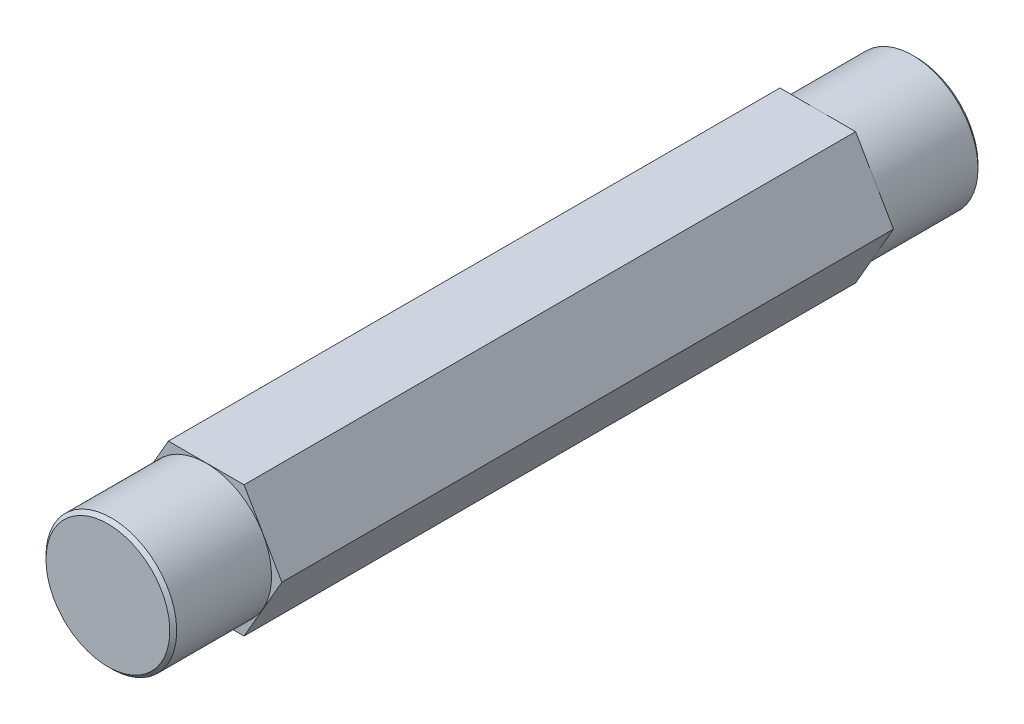
ISO-10303-21;
HEADER;
FILE_DESCRIPTION(('STEP AP214'),'2;1');
FILE_NAME('part.step','',(''),(''),'','','');
FILE_SCHEMA(('AUTOMOTIVE_DESIGN { 1 0 10303 214 1 1 1 1 }'));
ENDSEC;
DATA;
#1=APPLICATION_CONTEXT('core data for automotive mechanical design processes');
#2=APPLICATION_PROTOCOL_DEFINITION('international standard','automotive_design',2000,#1);
#3=PRODUCT_CONTEXT('',#1,'mechanical');
#4=PRODUCT('Part','Part','',(#3));
#5=PRODUCT_RELATED_PRODUCT_CATEGORY('part','',(#4));
#6=PRODUCT_DEFINITION_FORMATION('','',#4);
#7=PRODUCT_DEFINITION_CONTEXT('part definition',#1,'design');
#8=PRODUCT_DEFINITION('design','',#6,#7);
#9=PRODUCT_DEFINITION_SHAPE('','',#8);
#10=(LENGTH_UNIT() NAMED_UNIT(*) SI_UNIT(.MILLI.,.METRE.));
#11=(NAMED_UNIT(*) PLANE_ANGLE_UNIT() SI_UNIT($,.RADIAN.));
#12=(NAMED_UNIT(*) SI_UNIT($,.STERADIAN.) SOLID_ANGLE_UNIT());
#13=UNCERTAINTY_MEASURE_WITH_UNIT(LENGTH_MEASURE(1.E-05),#10,'distance_accuracy_value','');
#14=(GEOMETRIC_REPRESENTATION_CONTEXT(3) GLOBAL_UNCERTAINTY_ASSIGNED_CONTEXT((#13)) GLOBAL_UNIT_ASSIGNED_CONTEXT((#10,
#11,#12)) REPRESENTATION_CONTEXT('',''));
#15=CARTESIAN_POINT('',(0.,0.,0.));
#16=DIRECTION('',(0.,0.,1.));
#17=DIRECTION('',(1.,0.,0.));
#18=AXIS2_PLACEMENT_3D('',#15,#16,#17);
#19=CARTESIAN_POINT('',(0.,0.,29.36875));
#20=DIRECTION('',(0.,0.,1.));
#21=DIRECTION('',(1.,0.,0.));
#22=AXIS2_PLACEMENT_3D('',#19,#20,#21);
#23=PLANE('',#22);
#24=CARTESIAN_POINT('',(0.,0.,29.3687500000033));
#25=DIRECTION('',(0.,0.,-1.));
#26=DIRECTION('',(-1.,0.,0.));
#27=AXIS2_PLACEMENT_3D('',#24,#25,#26);
#28=CIRCLE('',#27,4.49980000001915);
#29=CARTESIAN_POINT('',(-4.49980000001915,0.,29.3687500000033));
#30=VERTEX_POINT('',#29);
#31=EDGE_CURVE('E20',#30,#30,#28,.T.);
#32=ORIENTED_EDGE('',*,*,#31,.F.);
#33=EDGE_LOOP('',(#32));
#34=FACE_BOUND('',#33,.T.);
#35=ADVANCED_FACE('F17',(#34),#23,.T.);
#36=CARTESIAN_POINT('',(0.,0.,-29.36875));
#37=DIRECTION('',(0.,0.,-1.));
#38=DIRECTION('',(-1.,0.,0.));
#39=AXIS2_PLACEMENT_3D('',#36,#37,#38);
#40=PLANE('',#39);
#41=CARTESIAN_POINT('',(0.,0.,-29.3687499999464));
#42=DIRECTION('',(0.,0.,1.));
#43=DIRECTION('',(0.,-1.,0.));
#44=AXIS2_PLACEMENT_3D('',#41,#42,#43);
#45=CIRCLE('',#44,4.49980000007599);
#46=CARTESIAN_POINT('',(0.,-4.49980000007599,-29.3687499999464));
#47=VERTEX_POINT('',#46);
#48=EDGE_CURVE('E109',#47,#47,#45,.T.);
#49=ORIENTED_EDGE('',*,*,#48,.F.);
#50=EDGE_LOOP('',(#49));
#51=FACE_BOUND('',#50,.T.);
#52=ADVANCED_FACE('F125',(#51),#40,.T.);
#53=CARTESIAN_POINT('',(0.,0.,29.118750000066));
#54=DIRECTION('',(0.,0.,-1.));
#55=DIRECTION('',(-1.,0.,0.));
#56=AXIS2_PLACEMENT_3D('',#53,#54,#55);
#57=CONICAL_SURFACE('',#56,4.74979999995639,0.785398163397448);
#58=CARTESIAN_POINT('',(0.,0.,29.11875));
#59=DIRECTION('',(0.,0.,-1.));
#60=DIRECTION('',(-1.,0.,0.));
#61=AXIS2_PLACEMENT_3D('',#58,#59,#60);
#62=CIRCLE('',#61,4.7498);
#63=CARTESIAN_POINT('',(-4.7498,0.,29.11875));
#64=VERTEX_POINT('',#63);
#65=EDGE_CURVE('E106',#64,#64,#62,.T.);
#66=ORIENTED_EDGE('',*,*,#65,.F.);
#67=EDGE_LOOP('',(#66));
#68=FACE_BOUND('',#67,.T.);
#69=ORIENTED_EDGE('',*,*,#31,.T.);
#70=EDGE_LOOP('',(#69));
#71=FACE_BOUND('',#70,.T.);
#72=ADVANCED_FACE('F122',(#68,#71),#57,.T.);
#73=CARTESIAN_POINT('',(0.,0.,-29.1187500001229));
#74=DIRECTION('',(0.,0.,1.));
#75=DIRECTION('',(0.,-1.,0.));
#76=AXIS2_PLACEMENT_3D('',#73,#74,#75);
#77=CONICAL_SURFACE('',#76,4.74979999984271,0.785398163283761);
#78=CARTESIAN_POINT('',(0.,0.,-29.11875));
#79=DIRECTION('',(0.,0.,1.));
#80=DIRECTION('',(1.,0.,0.));
#81=AXIS2_PLACEMENT_3D('',#78,#79,#80);
#82=CIRCLE('',#81,4.7498);
#83=CARTESIAN_POINT('',(4.7498,0.,-29.11875));
#84=VERTEX_POINT('',#83);
#85=EDGE_CURVE('E103',#84,#84,#82,.T.);
#86=ORIENTED_EDGE('',*,*,#85,.F.);
#87=EDGE_LOOP('',(#86));
#88=FACE_BOUND('',#87,.T.);
#89=ORIENTED_EDGE('',*,*,#48,.T.);
#90=EDGE_LOOP('',(#89));
#91=FACE_BOUND('',#90,.T.);
#92=ADVANCED_FACE('F168',(#88,#91),#77,.T.);
#93=CARTESIAN_POINT('',(0.,0.,29.36875));
#94=DIRECTION('',(0.,0.,-1.));
#95=DIRECTION('',(-1.,0.,0.));
#96=AXIS2_PLACEMENT_3D('',#93,#94,#95);
#97=CYLINDRICAL_SURFACE('',#96,4.7498);
#98=CARTESIAN_POINT('',(0.,0.,22.225));
#99=DIRECTION('',(0.,0.,-1.));
#100=DIRECTION('',(-1.,0.,0.));
#101=AXIS2_PLACEMENT_3D('',#98,#99,#100);
#102=CIRCLE('',#101,4.7498);
#103=CARTESIAN_POINT('',(-4.7498,0.,22.225));
#104=VERTEX_POINT('',#103);
#105=EDGE_CURVE('E91',#104,#104,#102,.T.);
#106=ORIENTED_EDGE('',*,*,#105,.F.);
#107=EDGE_LOOP('',(#106));
#108=FACE_BOUND('',#107,.T.);
#109=ORIENTED_EDGE('',*,*,#65,.T.);
#110=EDGE_LOOP('',(#109));
#111=FACE_BOUND('',#110,.T.);
#112=ADVANCED_FACE('F164',(#108,#111),#97,.T.);
#113=CARTESIAN_POINT('',(0.,0.,-29.36875));
#114=DIRECTION('',(0.,0.,1.));
#115=DIRECTION('',(1.,0.,0.));
#116=AXIS2_PLACEMENT_3D('',#113,#114,#115);
#117=CYLINDRICAL_SURFACE('',#116,4.7498);
#118=CARTESIAN_POINT('',(0.,0.,-22.225));
#119=DIRECTION('',(0.,0.,1.));
#120=DIRECTION('',(1.,0.,0.));
#121=AXIS2_PLACEMENT_3D('',#118,#119,#120);
#122=CIRCLE('',#121,4.7498);
#123=CARTESIAN_POINT('',(4.7498,0.,-22.225));
#124=VERTEX_POINT('',#123);
#125=EDGE_CURVE('E110',#124,#124,#122,.F.);
#126=ORIENTED_EDGE('',*,*,#125,.T.);
#127=EDGE_LOOP('',(#126));
#128=FACE_BOUND('',#127,.T.);
#129=ORIENTED_EDGE('',*,*,#85,.T.);
#130=EDGE_LOOP('',(#129));
#131=FACE_BOUND('',#130,.T.);
#132=ADVANCED_FACE('F160',(#128,#131),#117,.T.);
#133=CARTESIAN_POINT('',(-2.7496306570156,4.76250000000003,22.225));
#134=DIRECTION('',(0.866025403784439,-0.5,0.));
#135=DIRECTION('',(0.5,0.866025403784439,0.));
#136=AXIS2_PLACEMENT_3D('',#133,#134,#135);
#137=PLANE('',#136);
#138=DIRECTION('',(0.,0.,1.));
#139=VECTOR('',#138,1.);
#140=CARTESIAN_POINT('',(-5.49926131403121,0.,22.225));
#141=LINE('',#140,#139);
#142=CARTESIAN_POINT('',(-5.49926131403121,0.,-22.225));
#143=VERTEX_POINT('',#142);
#144=CARTESIAN_POINT('',(-5.49926131403121,0.,22.225));
#145=VERTEX_POINT('',#144);
#146=EDGE_CURVE('E101',#143,#145,#141,.T.);
#147=ORIENTED_EDGE('',*,*,#146,.T.);
#148=DIRECTION('',(-0.5,-0.866025403784439,0.));
#149=VECTOR('',#148,1.);
#150=CARTESIAN_POINT('',(-2.7496306570156,4.76250000000003,22.225));
#151=LINE('',#150,#149);
#152=CARTESIAN_POINT('',(-2.7496306570156,4.76250000000003,22.225));
#153=VERTEX_POINT('',#152);
#154=EDGE_CURVE('E66',#153,#145,#151,.T.);
#155=ORIENTED_EDGE('',*,*,#154,.F.);
#156=DIRECTION('',(0.,0.,-1.));
#157=VECTOR('',#156,1.);
#158=CARTESIAN_POINT('',(-2.7496306570156,4.76250000000003,22.225));
#159=LINE('',#158,#157);
#160=CARTESIAN_POINT('',(-2.7496306570156,4.76250000000003,-22.225));
#161=VERTEX_POINT('',#160);
#162=EDGE_CURVE('E113',#153,#161,#159,.T.);
#163=ORIENTED_EDGE('',*,*,#162,.T.);
#164=DIRECTION('',(-0.5,-0.866025403784439,0.));
#165=VECTOR('',#164,1.);
#166=CARTESIAN_POINT('',(-2.7496306570156,4.76250000000003,-22.225));
#167=LINE('',#166,#165);
#168=EDGE_CURVE('E271',#161,#143,#167,.T.);
#169=ORIENTED_EDGE('',*,*,#168,.T.);
#170=EDGE_LOOP('',(#147,#155,#163,#169));
#171=FACE_BOUND('',#170,.T.);
#172=ADVANCED_FACE('F156',(#171),#137,.F.);
#173=CARTESIAN_POINT('',(-5.49926131403121,0.,22.225));
#174=DIRECTION('',(0.866025403784439,0.5,0.));
#175=DIRECTION('',(-0.5,0.866025403784439,0.));
#176=AXIS2_PLACEMENT_3D('',#173,#174,#175);
#177=PLANE('',#176);
#178=DIRECTION('',(0.,0.,1.));
#179=VECTOR('',#178,1.);
#180=CARTESIAN_POINT('',(-2.7496306570156,-4.76250000000002,22.225));
#181=LINE('',#180,#179);
#182=CARTESIAN_POINT('',(-2.7496306570156,-4.76250000000002,-22.225));
#183=VERTEX_POINT('',#182);
#184=CARTESIAN_POINT('',(-2.7496306570156,-4.76250000000002,22.225));
#185=VERTEX_POINT('',#184);
#186=EDGE_CURVE('E83',#183,#185,#181,.T.);
#187=ORIENTED_EDGE('',*,*,#186,.T.);
#188=DIRECTION('',(0.5,-0.866025403784439,0.));
#189=VECTOR('',#188,1.);
#190=CARTESIAN_POINT('',(-5.49926131403121,0.,22.225));
#191=LINE('',#190,#189);
#192=EDGE_CURVE('E89',#145,#185,#191,.T.);
#193=ORIENTED_EDGE('',*,*,#192,.F.);
#194=ORIENTED_EDGE('',*,*,#146,.F.);
#195=DIRECTION('',(0.5,-0.866025403784439,0.));
#196=VECTOR('',#195,1.);
#197=CARTESIAN_POINT('',(-5.49926131403121,0.,-22.225));
#198=LINE('',#197,#196);
#199=EDGE_CURVE('E279',#143,#183,#198,.T.);
#200=ORIENTED_EDGE('',*,*,#199,.T.);
#201=EDGE_LOOP('',(#187,#193,#194,#200));
#202=FACE_BOUND('',#201,.T.);
#203=ADVANCED_FACE('F153',(#202),#177,.F.);
#204=CARTESIAN_POINT('',(-2.7496306570156,-4.76250000000002,22.225));
#205=DIRECTION('',(0.,1.,0.));
#206=DIRECTION('',(0.,0.,1.));
#207=AXIS2_PLACEMENT_3D('',#204,#205,#206);
#208=PLANE('',#207);
#209=DIRECTION('',(0.,0.,1.));
#210=VECTOR('',#209,1.);
#211=CARTESIAN_POINT('',(2.74963065701558,-4.76250000000002,22.225));
#212=LINE('',#211,#210);
#213=CARTESIAN_POINT('',(2.74963065701558,-4.76250000000002,-22.225));
#214=VERTEX_POINT('',#213);
#215=CARTESIAN_POINT('',(2.74963065701558,-4.76250000000002,22.225));
#216=VERTEX_POINT('',#215);
#217=EDGE_CURVE('E72',#214,#216,#212,.T.);
#218=ORIENTED_EDGE('',*,*,#217,.T.);
#219=DIRECTION('',(1.,0.,0.));
#220=VECTOR('',#219,1.);
#221=CARTESIAN_POINT('',(0.,-4.76250000000002,22.225));
#222=LINE('',#221,#220);
#223=EDGE_CURVE('E75',#185,#216,#222,.T.);
#224=ORIENTED_EDGE('',*,*,#223,.F.);
#225=ORIENTED_EDGE('',*,*,#186,.F.);
#226=DIRECTION('',(1.,0.,0.));
#227=VECTOR('',#226,1.);
#228=CARTESIAN_POINT('',(0.,-4.76250000000002,-22.225));
#229=LINE('',#228,#227);
#230=EDGE_CURVE('E77',#183,#214,#229,.T.);
#231=ORIENTED_EDGE('',*,*,#230,.T.);
#232=EDGE_LOOP('',(#218,#224,#225,#231));
#233=FACE_BOUND('',#232,.T.);
#234=ADVANCED_FACE('F74',(#233),#208,.F.);
#235=CARTESIAN_POINT('',(2.74963065701558,-4.76250000000002,22.225));
#236=DIRECTION('',(-0.866025403784439,0.499999999999999,0.));
#237=DIRECTION('',(-0.499999999999999,-0.866025403784439,0.));
#238=AXIS2_PLACEMENT_3D('',#235,#236,#237);
#239=PLANE('',#238);
#240=DIRECTION('',(0.,0.,1.));
#241=VECTOR('',#240,1.);
#242=CARTESIAN_POINT('',(5.49926131403118,0.,22.225));
#243=LINE('',#242,#241);
#244=CARTESIAN_POINT('',(5.49926131403118,0.,-22.225));
#245=VERTEX_POINT('',#244);
#246=CARTESIAN_POINT('',(5.49926131403118,0.,22.225));
#247=VERTEX_POINT('',#246);
#248=EDGE_CURVE('E95',#245,#247,#243,.T.);
#249=ORIENTED_EDGE('',*,*,#248,.T.);
#250=DIRECTION('',(0.499999999999999,0.866025403784439,0.));
#251=VECTOR('',#250,1.);
#252=CARTESIAN_POINT('',(2.74963065701558,-4.76250000000002,22.225));
#253=LINE('',#252,#251);
#254=EDGE_CURVE('E82',#216,#247,#253,.T.);
#255=ORIENTED_EDGE('',*,*,#254,.F.);
#256=ORIENTED_EDGE('',*,*,#217,.F.);
#257=DIRECTION('',(0.499999999999999,0.866025403784439,0.));
#258=VECTOR('',#257,1.);
#259=CARTESIAN_POINT('',(2.74963065701558,-4.76250000000002,-22.225));
#260=LINE('',#259,#258);
#261=EDGE_CURVE('E282',#214,#245,#260,.T.);
#262=ORIENTED_EDGE('',*,*,#261,.T.);
#263=EDGE_LOOP('',(#249,#255,#256,#262));
#264=FACE_BOUND('',#263,.T.);
#265=ADVANCED_FACE('F94',(#264),#239,.F.);
#266=CARTESIAN_POINT('',(0.,0.,22.225));
#267=DIRECTION('',(0.,0.,1.));
#268=DIRECTION('',(1.,0.,0.));
#269=AXIS2_PLACEMENT_3D('',#266,#267,#268);
#270=PLANE('',#269);
#271=ORIENTED_EDGE('',*,*,#105,.T.);
#272=EDGE_LOOP('',(#271));
#273=FACE_BOUND('',#272,.T.);
#274=ORIENTED_EDGE('',*,*,#192,.T.);
#275=ORIENTED_EDGE('',*,*,#223,.T.);
#276=ORIENTED_EDGE('',*,*,#254,.T.);
#277=DIRECTION('',(0.5,-0.866025403784439,0.));
#278=VECTOR('',#277,1.);
#279=CARTESIAN_POINT('',(5.49926131403118,0.,22.225));
#280=LINE('',#279,#278);
#281=CARTESIAN_POINT('',(2.74963065701557,4.76250000000003,22.225));
#282=VERTEX_POINT('',#281);
#283=EDGE_CURVE('E285',#247,#282,#280,.F.);
#284=ORIENTED_EDGE('',*,*,#283,.T.);
#285=DIRECTION('',(1.,0.,0.));
#286=VECTOR('',#285,1.);
#287=CARTESIAN_POINT('',(2.74963065701557,4.76250000000003,22.225));
#288=LINE('',#287,#286);
#289=EDGE_CURVE('E115',#282,#153,#288,.F.);
#290=ORIENTED_EDGE('',*,*,#289,.T.);
#291=ORIENTED_EDGE('',*,*,#154,.T.);
#292=EDGE_LOOP('',(#274,#275,#276,#284,#290,#291));
#293=FACE_BOUND('',#292,.T.);
#294=ADVANCED_FACE('F85',(#273,#293),#270,.T.);
#295=CARTESIAN_POINT('',(2.74963065701557,4.76250000000003,22.225));
#296=DIRECTION('',(0.,-1.,0.));
#297=DIRECTION('',(0.,0.,-1.));
#298=AXIS2_PLACEMENT_3D('',#295,#296,#297);
#299=PLANE('',#298);
#300=ORIENTED_EDGE('',*,*,#162,.F.);
#301=ORIENTED_EDGE('',*,*,#289,.F.);
#302=DIRECTION('',(0.,0.,1.));
#303=VECTOR('',#302,1.);
#304=CARTESIAN_POINT('',(2.74963065701557,4.76250000000003,22.225));
#305=LINE('',#304,#303);
#306=CARTESIAN_POINT('',(2.74963065701557,4.76250000000003,-22.225));
#307=VERTEX_POINT('',#306);
#308=EDGE_CURVE('E26',#282,#307,#305,.F.);
#309=ORIENTED_EDGE('',*,*,#308,.T.);
#310=DIRECTION('',(1.,0.,0.));
#311=VECTOR('',#310,1.);
#312=CARTESIAN_POINT('',(0.,4.76250000000003,-22.225));
#313=LINE('',#312,#311);
#314=EDGE_CURVE('E34',#307,#161,#313,.F.);
#315=ORIENTED_EDGE('',*,*,#314,.T.);
#316=EDGE_LOOP('',(#300,#301,#309,#315));
#317=FACE_BOUND('',#316,.T.);
#318=ADVANCED_FACE('F139',(#317),#299,.F.);
#319=CARTESIAN_POINT('',(0.,0.,-22.225));
#320=DIRECTION('',(0.,0.,1.));
#321=DIRECTION('',(1.,0.,0.));
#322=AXIS2_PLACEMENT_3D('',#319,#320,#321);
#323=PLANE('',#322);
#324=ORIENTED_EDGE('',*,*,#230,.F.);
#325=ORIENTED_EDGE('',*,*,#199,.F.);
#326=ORIENTED_EDGE('',*,*,#168,.F.);
#327=ORIENTED_EDGE('',*,*,#314,.F.);
#328=DIRECTION('',(0.5,-0.866025403784439,0.));
#329=VECTOR('',#328,1.);
#330=CARTESIAN_POINT('',(5.49926131403118,0.,-22.225));
#331=LINE('',#330,#329);
#332=EDGE_CURVE('E11',#307,#245,#331,.T.);
#333=ORIENTED_EDGE('',*,*,#332,.T.);
#334=ORIENTED_EDGE('',*,*,#261,.F.);
#335=EDGE_LOOP('',(#324,#325,#326,#327,#333,#334));
#336=FACE_BOUND('',#335,.T.);
#337=ORIENTED_EDGE('',*,*,#125,.F.);
#338=EDGE_LOOP('',(#337));
#339=FACE_BOUND('',#338,.T.);
#340=ADVANCED_FACE('F133',(#336,#339),#323,.F.);
#341=CARTESIAN_POINT('',(5.49926131403118,0.,22.225));
#342=DIRECTION('',(-0.866025403784439,-0.5,0.));
#343=DIRECTION('',(0.5,-0.866025403784439,0.));
#344=AXIS2_PLACEMENT_3D('',#341,#342,#343);
#345=PLANE('',#344);
#346=ORIENTED_EDGE('',*,*,#308,.F.);
#347=ORIENTED_EDGE('',*,*,#283,.F.);
#348=ORIENTED_EDGE('',*,*,#248,.F.);
#349=ORIENTED_EDGE('',*,*,#332,.F.);
#350=EDGE_LOOP('',(#346,#347,#348,#349));
#351=FACE_BOUND('',#350,.T.);
#352=ADVANCED_FACE('F131',(#351),#345,.F.);
#353=CLOSED_SHELL('',(#35,#52,#72,#92,#112,#132,#172,#203,#234,#265,#294,#318,#340,#352));
#354=MANIFOLD_SOLID_BREP('B1',#353);
#355=ADVANCED_BREP_SHAPE_REPRESENTATION('',(#18,#354),#14);
#356=SHAPE_DEFINITION_REPRESENTATION(#9,#355);
ENDSEC;
END-ISO-10303-21;
